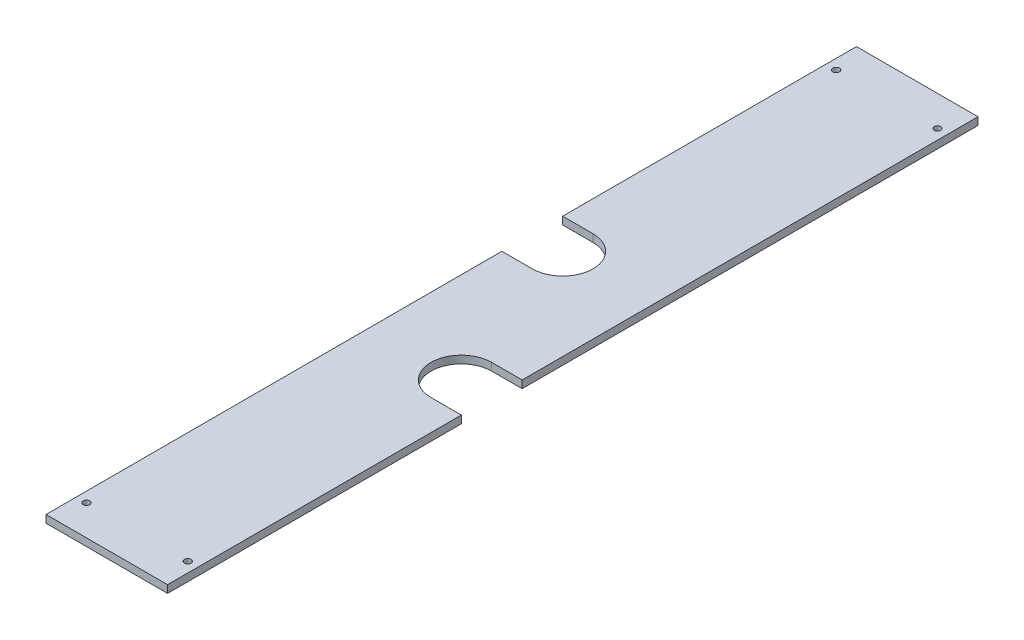
ISO-10303-21;
HEADER;
FILE_DESCRIPTION(('STEP AP214'),'2;1');
FILE_NAME('part.step','',(''),(''),'','','');
FILE_SCHEMA(('AUTOMOTIVE_DESIGN { 1 0 10303 214 1 1 1 1 }'));
ENDSEC;
DATA;
#1=APPLICATION_CONTEXT('core data for automotive mechanical design processes');
#2=APPLICATION_PROTOCOL_DEFINITION('international standard','automotive_design',2000,#1);
#3=PRODUCT_CONTEXT('',#1,'mechanical');
#4=PRODUCT('Part','Part','',(#3));
#5=PRODUCT_RELATED_PRODUCT_CATEGORY('part','',(#4));
#6=PRODUCT_DEFINITION_FORMATION('','',#4);
#7=PRODUCT_DEFINITION_CONTEXT('part definition',#1,'design');
#8=PRODUCT_DEFINITION('design','',#6,#7);
#9=PRODUCT_DEFINITION_SHAPE('','',#8);
#10=(LENGTH_UNIT() NAMED_UNIT(*) SI_UNIT(.MILLI.,.METRE.));
#11=(NAMED_UNIT(*) PLANE_ANGLE_UNIT() SI_UNIT($,.RADIAN.));
#12=(NAMED_UNIT(*) SI_UNIT($,.STERADIAN.) SOLID_ANGLE_UNIT());
#13=UNCERTAINTY_MEASURE_WITH_UNIT(LENGTH_MEASURE(1.E-05),#10,'distance_accuracy_value','');
#14=(GEOMETRIC_REPRESENTATION_CONTEXT(3) GLOBAL_UNCERTAINTY_ASSIGNED_CONTEXT((#13)) GLOBAL_UNIT_ASSIGNED_CONTEXT((#10,
#11,#12)) REPRESENTATION_CONTEXT('',''));
#15=CARTESIAN_POINT('',(0.,0.,0.));
#16=DIRECTION('',(0.,0.,1.));
#17=DIRECTION('',(1.,0.,0.));
#18=AXIS2_PLACEMENT_3D('',#15,#16,#17);
#19=CARTESIAN_POINT('',(-38.1,22.8952505991963,508.));
#20=DIRECTION('',(1.,0.,0.));
#21=DIRECTION('',(0.,0.,-1.));
#22=AXIS2_PLACEMENT_3D('',#19,#20,#21);
#23=PLANE('',#22);
#24=DIRECTION('',(0.,0.,-1.));
#25=VECTOR('',#24,1.);
#26=CARTESIAN_POINT('',(-38.1,22.8952505991963,508.));
#27=LINE('',#26,#25);
#28=CARTESIAN_POINT('',(-38.1,22.8952505991963,508.));
#29=VERTEX_POINT('',#28);
#30=CARTESIAN_POINT('',(-38.1,22.8952505991963,222.25));
#31=VERTEX_POINT('',#30);
#32=EDGE_CURVE('E211',#29,#31,#27,.T.);
#33=ORIENTED_EDGE('',*,*,#32,.T.);
#34=DIRECTION('',(0.,1.,0.));
#35=VECTOR('',#34,1.);
#36=CARTESIAN_POINT('',(-38.1,18.1327505991963,222.25));
#37=LINE('',#36,#35);
#38=CARTESIAN_POINT('',(-38.1,18.1327505991963,222.25));
#39=VERTEX_POINT('',#38);
#40=EDGE_CURVE('E160',#39,#31,#37,.T.);
#41=ORIENTED_EDGE('',*,*,#40,.F.);
#42=DIRECTION('',(0.,0.,-1.));
#43=VECTOR('',#42,1.);
#44=CARTESIAN_POINT('',(-38.1,18.1327505991963,508.));
#45=LINE('',#44,#43);
#46=CARTESIAN_POINT('',(-38.1,18.1327505991963,508.));
#47=VERTEX_POINT('',#46);
#48=EDGE_CURVE('E11',#47,#39,#45,.T.);
#49=ORIENTED_EDGE('',*,*,#48,.F.);
#50=DIRECTION('',(0.,-1.,0.));
#51=VECTOR('',#50,1.);
#52=CARTESIAN_POINT('',(-38.1,22.8952505991963,508.));
#53=LINE('',#52,#51);
#54=EDGE_CURVE('E188',#29,#47,#53,.T.);
#55=ORIENTED_EDGE('',*,*,#54,.F.);
#56=EDGE_LOOP('',(#33,#41,#49,#55));
#57=FACE_BOUND('',#56,.T.);
#58=ADVANCED_FACE('F39',(#57),#23,.F.);
#59=CARTESIAN_POINT('',(38.1,22.8952505991963,508.));
#60=DIRECTION('',(1.,0.,0.));
#61=DIRECTION('',(0.,0.,-1.));
#62=AXIS2_PLACEMENT_3D('',#59,#60,#61);
#63=PLANE('',#62);
#64=DIRECTION('',(0.,1.,0.));
#65=VECTOR('',#64,1.);
#66=CARTESIAN_POINT('',(38.1,18.1327505991963,285.75));
#67=LINE('',#66,#65);
#68=CARTESIAN_POINT('',(38.1,18.1327505991963,285.75));
#69=VERTEX_POINT('',#68);
#70=CARTESIAN_POINT('',(38.1,22.8952505991963,285.75));
#71=VERTEX_POINT('',#70);
#72=EDGE_CURVE('E169',#69,#71,#67,.T.);
#73=ORIENTED_EDGE('',*,*,#72,.F.);
#74=DIRECTION('',(0.,0.,-1.));
#75=VECTOR('',#74,1.);
#76=CARTESIAN_POINT('',(38.1,18.1327505991963,508.));
#77=LINE('',#76,#75);
#78=CARTESIAN_POINT('',(38.1,18.1327505991963,0.));
#79=VERTEX_POINT('',#78);
#80=EDGE_CURVE('E217',#69,#79,#77,.T.);
#81=ORIENTED_EDGE('',*,*,#80,.T.);
#82=DIRECTION('',(0.,-1.,0.));
#83=VECTOR('',#82,1.);
#84=CARTESIAN_POINT('',(38.1,22.8952505991963,0.));
#85=LINE('',#84,#83);
#86=CARTESIAN_POINT('',(38.1,22.8952505991963,0.));
#87=VERTEX_POINT('',#86);
#88=EDGE_CURVE('E206',#87,#79,#85,.T.);
#89=ORIENTED_EDGE('',*,*,#88,.F.);
#90=DIRECTION('',(0.,0.,-1.));
#91=VECTOR('',#90,1.);
#92=CARTESIAN_POINT('',(38.1,22.8952505991963,508.));
#93=LINE('',#92,#91);
#94=EDGE_CURVE('E214',#71,#87,#93,.T.);
#95=ORIENTED_EDGE('',*,*,#94,.F.);
#96=EDGE_LOOP('',(#73,#81,#89,#95));
#97=FACE_BOUND('',#96,.T.);
#98=ADVANCED_FACE('F226',(#97),#63,.T.);
#99=CARTESIAN_POINT('',(-38.1,18.1327505991963,184.15));
#100=VERTEX_POINT('',#99);
#101=CARTESIAN_POINT('',(-38.1,18.1327505991963,0.));
#102=VERTEX_POINT('',#101);
#103=EDGE_CURVE('E47',#100,#102,#45,.T.);
#104=ORIENTED_EDGE('',*,*,#103,.F.);
#105=DIRECTION('',(0.,1.,0.));
#106=VECTOR('',#105,1.);
#107=CARTESIAN_POINT('',(-38.1,18.1327505991963,184.15));
#108=LINE('',#107,#106);
#109=CARTESIAN_POINT('',(-38.1,22.8952505991963,184.15));
#110=VERTEX_POINT('',#109);
#111=EDGE_CURVE('E134',#100,#110,#108,.T.);
#112=ORIENTED_EDGE('',*,*,#111,.T.);
#113=CARTESIAN_POINT('',(-38.1,22.8952505991963,0.));
#114=VERTEX_POINT('',#113);
#115=EDGE_CURVE('E200',#110,#114,#27,.T.);
#116=ORIENTED_EDGE('',*,*,#115,.T.);
#117=DIRECTION('',(0.,-1.,0.));
#118=VECTOR('',#117,1.);
#119=CARTESIAN_POINT('',(-38.1,22.8952505991963,0.));
#120=LINE('',#119,#118);
#121=EDGE_CURVE('E159',#114,#102,#120,.T.);
#122=ORIENTED_EDGE('',*,*,#121,.T.);
#123=EDGE_LOOP('',(#104,#112,#116,#122));
#124=FACE_BOUND('',#123,.T.);
#125=ADVANCED_FACE('F41',(#124),#23,.F.);
#126=CARTESIAN_POINT('',(-38.1,18.1327505991963,508.));
#127=DIRECTION('',(0.,1.,0.));
#128=DIRECTION('',(0.,0.,1.));
#129=AXIS2_PLACEMENT_3D('',#126,#127,#128);
#130=PLANE('',#129);
#131=CARTESIAN_POINT('',(-31.75,18.1327505991963,19.05));
#132=DIRECTION('',(0.,-1.,0.));
#133=DIRECTION('',(0.,0.,-1.));
#134=AXIS2_PLACEMENT_3D('',#131,#132,#133);
#135=CIRCLE('',#134,2.08280000000002);
#136=CARTESIAN_POINT('',(-31.75,18.1327505991963,16.9672));
#137=VERTEX_POINT('',#136);
#138=EDGE_CURVE('E447',#137,#137,#135,.T.);
#139=ORIENTED_EDGE('',*,*,#138,.F.);
#140=EDGE_LOOP('',(#139));
#141=FACE_BOUND('',#140,.T.);
#142=CARTESIAN_POINT('',(31.75,18.1327505991963,488.95));
#143=DIRECTION('',(0.,-1.,0.));
#144=DIRECTION('',(0.,0.,-1.));
#145=AXIS2_PLACEMENT_3D('',#142,#143,#144);
#146=CIRCLE('',#145,2.0828);
#147=CARTESIAN_POINT('',(31.75,18.1327505991963,486.8672));
#148=VERTEX_POINT('',#147);
#149=EDGE_CURVE('E451',#148,#148,#146,.T.);
#150=ORIENTED_EDGE('',*,*,#149,.F.);
#151=EDGE_LOOP('',(#150));
#152=FACE_BOUND('',#151,.T.);
#153=CARTESIAN_POINT('',(-31.75,18.1327505991963,488.95));
#154=DIRECTION('',(0.,1.,0.));
#155=DIRECTION('',(0.,0.,1.));
#156=AXIS2_PLACEMENT_3D('',#153,#154,#155);
#157=CIRCLE('',#156,2.08280000000002);
#158=CARTESIAN_POINT('',(-31.75,18.1327505991963,491.0328));
#159=VERTEX_POINT('',#158);
#160=EDGE_CURVE('E173',#159,#159,#157,.T.);
#161=ORIENTED_EDGE('',*,*,#160,.T.);
#162=EDGE_LOOP('',(#161));
#163=FACE_BOUND('',#162,.T.);
#164=CARTESIAN_POINT('',(31.75,18.1327505991963,19.05));
#165=DIRECTION('',(0.,1.,0.));
#166=DIRECTION('',(0.,0.,1.));
#167=AXIS2_PLACEMENT_3D('',#164,#165,#166);
#168=CIRCLE('',#167,2.0828);
#169=CARTESIAN_POINT('',(31.75,18.1327505991963,21.1328));
#170=VERTEX_POINT('',#169);
#171=EDGE_CURVE('E151',#170,#170,#168,.T.);
#172=ORIENTED_EDGE('',*,*,#171,.T.);
#173=EDGE_LOOP('',(#172));
#174=FACE_BOUND('',#173,.T.);
#175=ORIENTED_EDGE('',*,*,#48,.T.);
#176=DIRECTION('',(1.,0.,0.));
#177=VECTOR('',#176,1.);
#178=CARTESIAN_POINT('',(-38.1,18.1327505991963,222.25));
#179=LINE('',#178,#177);
#180=CARTESIAN_POINT('',(-19.05,18.1327505991963,222.25));
#181=VERTEX_POINT('',#180);
#182=EDGE_CURVE('E135',#39,#181,#179,.T.);
#183=ORIENTED_EDGE('',*,*,#182,.T.);
#184=CARTESIAN_POINT('',(-19.05,18.1327505991963,203.2));
#185=DIRECTION('',(0.,1.,0.));
#186=DIRECTION('',(0.,0.,1.));
#187=AXIS2_PLACEMENT_3D('',#184,#185,#186);
#188=CIRCLE('',#187,19.05);
#189=CARTESIAN_POINT('',(-19.05,18.1327505991963,184.15));
#190=VERTEX_POINT('',#189);
#191=EDGE_CURVE('E130',#181,#190,#188,.T.);
#192=ORIENTED_EDGE('',*,*,#191,.T.);
#193=DIRECTION('',(-1.,0.,0.));
#194=VECTOR('',#193,1.);
#195=CARTESIAN_POINT('',(-19.05,18.1327505991963,184.15));
#196=LINE('',#195,#194);
#197=EDGE_CURVE('E138',#190,#100,#196,.T.);
#198=ORIENTED_EDGE('',*,*,#197,.T.);
#199=ORIENTED_EDGE('',*,*,#103,.T.);
#200=DIRECTION('',(1.,0.,0.));
#201=VECTOR('',#200,1.);
#202=CARTESIAN_POINT('',(-38.1,18.1327505991963,0.));
#203=LINE('',#202,#201);
#204=EDGE_CURVE('E203',#102,#79,#203,.T.);
#205=ORIENTED_EDGE('',*,*,#204,.T.);
#206=ORIENTED_EDGE('',*,*,#80,.F.);
#207=DIRECTION('',(-1.,0.,0.));
#208=VECTOR('',#207,1.);
#209=CARTESIAN_POINT('',(38.1,18.1327505991963,285.75));
#210=LINE('',#209,#208);
#211=CARTESIAN_POINT('',(19.05,18.1327505991963,285.75));
#212=VERTEX_POINT('',#211);
#213=EDGE_CURVE('E165',#69,#212,#210,.T.);
#214=ORIENTED_EDGE('',*,*,#213,.T.);
#215=CARTESIAN_POINT('',(19.05,18.1327505991963,304.8));
#216=DIRECTION('',(0.,1.,0.));
#217=DIRECTION('',(0.,0.,1.));
#218=AXIS2_PLACEMENT_3D('',#215,#216,#217);
#219=CIRCLE('',#218,19.05);
#220=CARTESIAN_POINT('',(19.05,18.1327505991963,323.85));
#221=VERTEX_POINT('',#220);
#222=EDGE_CURVE('E178',#212,#221,#219,.T.);
#223=ORIENTED_EDGE('',*,*,#222,.T.);
#224=DIRECTION('',(1.,0.,0.));
#225=VECTOR('',#224,1.);
#226=CARTESIAN_POINT('',(19.05,18.1327505991963,323.85));
#227=LINE('',#226,#225);
#228=CARTESIAN_POINT('',(38.1,18.1327505991963,323.85));
#229=VERTEX_POINT('',#228);
#230=EDGE_CURVE('E183',#221,#229,#227,.T.);
#231=ORIENTED_EDGE('',*,*,#230,.T.);
#232=CARTESIAN_POINT('',(38.1,18.1327505991963,508.));
#233=VERTEX_POINT('',#232);
#234=EDGE_CURVE('E218',#233,#229,#77,.T.);
#235=ORIENTED_EDGE('',*,*,#234,.F.);
#236=DIRECTION('',(1.,0.,0.));
#237=VECTOR('',#236,1.);
#238=CARTESIAN_POINT('',(-38.1,18.1327505991963,508.));
#239=LINE('',#238,#237);
#240=EDGE_CURVE('E191',#47,#233,#239,.T.);
#241=ORIENTED_EDGE('',*,*,#240,.F.);
#242=EDGE_LOOP('',(#175,#183,#192,#198,#199,#205,#206,#214,#223,#231,#235,#241));
#243=FACE_BOUND('',#242,.T.);
#244=ADVANCED_FACE('F144',(#141,#152,#163,#174,#243),#130,.F.);
#245=DIRECTION('',(0.,1.,0.));
#246=VECTOR('',#245,1.);
#247=CARTESIAN_POINT('',(38.1,18.1327505991963,323.85));
#248=LINE('',#247,#246);
#249=CARTESIAN_POINT('',(38.1,22.8952505991963,323.85));
#250=VERTEX_POINT('',#249);
#251=EDGE_CURVE('E166',#229,#250,#248,.T.);
#252=ORIENTED_EDGE('',*,*,#251,.T.);
#253=CARTESIAN_POINT('',(38.1,22.8952505991963,508.));
#254=VERTEX_POINT('',#253);
#255=EDGE_CURVE('E215',#254,#250,#93,.T.);
#256=ORIENTED_EDGE('',*,*,#255,.F.);
#257=DIRECTION('',(0.,-1.,0.));
#258=VECTOR('',#257,1.);
#259=CARTESIAN_POINT('',(38.1,22.8952505991963,508.));
#260=LINE('',#259,#258);
#261=EDGE_CURVE('E194',#254,#233,#260,.T.);
#262=ORIENTED_EDGE('',*,*,#261,.T.);
#263=ORIENTED_EDGE('',*,*,#234,.T.);
#264=EDGE_LOOP('',(#252,#256,#262,#263));
#265=FACE_BOUND('',#264,.T.);
#266=ADVANCED_FACE('F246',(#265),#63,.T.);
#267=CARTESIAN_POINT('',(-38.1,22.8952505991963,508.));
#268=DIRECTION('',(0.,1.,0.));
#269=DIRECTION('',(0.,0.,1.));
#270=AXIS2_PLACEMENT_3D('',#267,#268,#269);
#271=PLANE('',#270);
#272=CARTESIAN_POINT('',(-31.75,22.8952505991963,19.05));
#273=DIRECTION('',(0.,-1.,0.));
#274=DIRECTION('',(0.,0.,-1.));
#275=AXIS2_PLACEMENT_3D('',#272,#273,#274);
#276=CIRCLE('',#275,2.08280000000002);
#277=CARTESIAN_POINT('',(-31.75,22.8952505991963,16.9672));
#278=VERTEX_POINT('',#277);
#279=EDGE_CURVE('E450',#278,#278,#276,.T.);
#280=ORIENTED_EDGE('',*,*,#279,.T.);
#281=EDGE_LOOP('',(#280));
#282=FACE_BOUND('',#281,.T.);
#283=CARTESIAN_POINT('',(31.75,22.8952505991963,488.95));
#284=DIRECTION('',(0.,-1.,0.));
#285=DIRECTION('',(0.,0.,-1.));
#286=AXIS2_PLACEMENT_3D('',#283,#284,#285);
#287=CIRCLE('',#286,2.0828);
#288=CARTESIAN_POINT('',(31.75,22.8952505991963,486.8672));
#289=VERTEX_POINT('',#288);
#290=EDGE_CURVE('E455',#289,#289,#287,.T.);
#291=ORIENTED_EDGE('',*,*,#290,.T.);
#292=EDGE_LOOP('',(#291));
#293=FACE_BOUND('',#292,.T.);
#294=CARTESIAN_POINT('',(-31.75,22.8952505991963,488.95));
#295=DIRECTION('',(0.,1.,0.));
#296=DIRECTION('',(0.,0.,1.));
#297=AXIS2_PLACEMENT_3D('',#294,#295,#296);
#298=CIRCLE('',#297,2.08280000000002);
#299=CARTESIAN_POINT('',(-31.75,22.8952505991963,491.0328));
#300=VERTEX_POINT('',#299);
#301=EDGE_CURVE('E462',#300,#300,#298,.T.);
#302=ORIENTED_EDGE('',*,*,#301,.F.);
#303=EDGE_LOOP('',(#302));
#304=FACE_BOUND('',#303,.T.);
#305=CARTESIAN_POINT('',(31.75,22.8952505991963,19.05));
#306=DIRECTION('',(0.,1.,0.));
#307=DIRECTION('',(0.,0.,1.));
#308=AXIS2_PLACEMENT_3D('',#305,#306,#307);
#309=CIRCLE('',#308,2.0828);
#310=CARTESIAN_POINT('',(31.75,22.8952505991963,21.1328));
#311=VERTEX_POINT('',#310);
#312=EDGE_CURVE('E464',#311,#311,#309,.T.);
#313=ORIENTED_EDGE('',*,*,#312,.F.);
#314=EDGE_LOOP('',(#313));
#315=FACE_BOUND('',#314,.T.);
#316=DIRECTION('',(1.,0.,0.));
#317=VECTOR('',#316,1.);
#318=CARTESIAN_POINT('',(-38.1,22.8952505991963,222.25));
#319=LINE('',#318,#317);
#320=CARTESIAN_POINT('',(-19.05,22.8952505991963,222.25));
#321=VERTEX_POINT('',#320);
#322=EDGE_CURVE('E145',#31,#321,#319,.T.);
#323=ORIENTED_EDGE('',*,*,#322,.F.);
#324=ORIENTED_EDGE('',*,*,#32,.F.);
#325=DIRECTION('',(1.,0.,0.));
#326=VECTOR('',#325,1.);
#327=CARTESIAN_POINT('',(-38.1,22.8952505991963,508.));
#328=LINE('',#327,#326);
#329=EDGE_CURVE('E197',#29,#254,#328,.T.);
#330=ORIENTED_EDGE('',*,*,#329,.T.);
#331=ORIENTED_EDGE('',*,*,#255,.T.);
#332=DIRECTION('',(1.,0.,0.));
#333=VECTOR('',#332,1.);
#334=CARTESIAN_POINT('',(19.05,22.8952505991963,323.85));
#335=LINE('',#334,#333);
#336=CARTESIAN_POINT('',(19.05,22.8952505991963,323.85));
#337=VERTEX_POINT('',#336);
#338=EDGE_CURVE('E177',#337,#250,#335,.T.);
#339=ORIENTED_EDGE('',*,*,#338,.F.);
#340=CARTESIAN_POINT('',(19.05,22.8952505991963,304.8));
#341=DIRECTION('',(0.,1.,0.));
#342=DIRECTION('',(0.,0.,1.));
#343=AXIS2_PLACEMENT_3D('',#340,#341,#342);
#344=CIRCLE('',#343,19.05);
#345=CARTESIAN_POINT('',(19.05,22.8952505991963,285.75));
#346=VERTEX_POINT('',#345);
#347=EDGE_CURVE('E62',#346,#337,#344,.T.);
#348=ORIENTED_EDGE('',*,*,#347,.F.);
#349=DIRECTION('',(-1.,0.,0.));
#350=VECTOR('',#349,1.);
#351=CARTESIAN_POINT('',(38.1,22.8952505991963,285.75));
#352=LINE('',#351,#350);
#353=EDGE_CURVE('E174',#71,#346,#352,.T.);
#354=ORIENTED_EDGE('',*,*,#353,.F.);
#355=ORIENTED_EDGE('',*,*,#94,.T.);
#356=DIRECTION('',(1.,0.,0.));
#357=VECTOR('',#356,1.);
#358=CARTESIAN_POINT('',(-38.1,22.8952505991963,0.));
#359=LINE('',#358,#357);
#360=EDGE_CURVE('E192',#114,#87,#359,.T.);
#361=ORIENTED_EDGE('',*,*,#360,.F.);
#362=ORIENTED_EDGE('',*,*,#115,.F.);
#363=DIRECTION('',(-1.,0.,0.));
#364=VECTOR('',#363,1.);
#365=CARTESIAN_POINT('',(-19.05,22.8952505991963,184.15));
#366=LINE('',#365,#364);
#367=CARTESIAN_POINT('',(-19.05,22.8952505991963,184.15));
#368=VERTEX_POINT('',#367);
#369=EDGE_CURVE('E148',#368,#110,#366,.T.);
#370=ORIENTED_EDGE('',*,*,#369,.F.);
#371=CARTESIAN_POINT('',(-19.05,22.8952505991963,203.2));
#372=DIRECTION('',(0.,1.,0.));
#373=DIRECTION('',(0.,0.,1.));
#374=AXIS2_PLACEMENT_3D('',#371,#372,#373);
#375=CIRCLE('',#374,19.05);
#376=EDGE_CURVE('E54',#321,#368,#375,.T.);
#377=ORIENTED_EDGE('',*,*,#376,.F.);
#378=EDGE_LOOP('',(#323,#324,#330,#331,#339,#348,#354,#355,#361,#362,#370,#377));
#379=FACE_BOUND('',#378,.T.);
#380=ADVANCED_FACE('F236',(#282,#293,#304,#315,#379),#271,.T.);
#381=CARTESIAN_POINT('',(0.,0.,508.));
#382=DIRECTION('',(0.,0.,1.));
#383=DIRECTION('',(1.,0.,0.));
#384=AXIS2_PLACEMENT_3D('',#381,#382,#383);
#385=PLANE('',#384);
#386=ORIENTED_EDGE('',*,*,#54,.T.);
#387=ORIENTED_EDGE('',*,*,#240,.T.);
#388=ORIENTED_EDGE('',*,*,#261,.F.);
#389=ORIENTED_EDGE('',*,*,#329,.F.);
#390=EDGE_LOOP('',(#386,#387,#388,#389));
#391=FACE_BOUND('',#390,.T.);
#392=ADVANCED_FACE('F251',(#391),#385,.T.);
#393=CARTESIAN_POINT('',(0.,0.,0.));
#394=DIRECTION('',(0.,0.,1.));
#395=DIRECTION('',(1.,0.,0.));
#396=AXIS2_PLACEMENT_3D('',#393,#394,#395);
#397=PLANE('',#396);
#398=ORIENTED_EDGE('',*,*,#121,.F.);
#399=ORIENTED_EDGE('',*,*,#360,.T.);
#400=ORIENTED_EDGE('',*,*,#88,.T.);
#401=ORIENTED_EDGE('',*,*,#204,.F.);
#402=EDGE_LOOP('',(#398,#399,#400,#401));
#403=FACE_BOUND('',#402,.T.);
#404=ADVANCED_FACE('F231',(#403),#397,.F.);
#405=CARTESIAN_POINT('',(19.05,18.1327505991963,304.8));
#406=DIRECTION('',(0.,1.,0.));
#407=DIRECTION('',(0.,0.,1.));
#408=AXIS2_PLACEMENT_3D('',#405,#406,#407);
#409=CYLINDRICAL_SURFACE('',#408,19.05);
#410=ORIENTED_EDGE('',*,*,#347,.T.);
#411=DIRECTION('',(0.,1.,0.));
#412=VECTOR('',#411,1.);
#413=CARTESIAN_POINT('',(19.05,18.1327505991963,323.85));
#414=LINE('',#413,#412);
#415=EDGE_CURVE('E163',#221,#337,#414,.T.);
#416=ORIENTED_EDGE('',*,*,#415,.F.);
#417=ORIENTED_EDGE('',*,*,#222,.F.);
#418=DIRECTION('',(0.,1.,0.));
#419=VECTOR('',#418,1.);
#420=CARTESIAN_POINT('',(19.05,18.1327505991963,285.75));
#421=LINE('',#420,#419);
#422=EDGE_CURVE('E171',#212,#346,#421,.T.);
#423=ORIENTED_EDGE('',*,*,#422,.T.);
#424=EDGE_LOOP('',(#410,#416,#417,#423));
#425=FACE_BOUND('',#424,.T.);
#426=ADVANCED_FACE('F243',(#425),#409,.F.);
#427=CARTESIAN_POINT('',(38.1,18.1327505991963,285.75));
#428=DIRECTION('',(0.,0.,-1.));
#429=DIRECTION('',(-1.,0.,0.));
#430=AXIS2_PLACEMENT_3D('',#427,#428,#429);
#431=PLANE('',#430);
#432=ORIENTED_EDGE('',*,*,#353,.T.);
#433=ORIENTED_EDGE('',*,*,#422,.F.);
#434=ORIENTED_EDGE('',*,*,#213,.F.);
#435=ORIENTED_EDGE('',*,*,#72,.T.);
#436=EDGE_LOOP('',(#432,#433,#434,#435));
#437=FACE_BOUND('',#436,.T.);
#438=ADVANCED_FACE('F240',(#437),#431,.F.);
#439=CARTESIAN_POINT('',(19.05,18.1327505991963,323.85));
#440=DIRECTION('',(0.,0.,1.));
#441=DIRECTION('',(1.,0.,0.));
#442=AXIS2_PLACEMENT_3D('',#439,#440,#441);
#443=PLANE('',#442);
#444=ORIENTED_EDGE('',*,*,#338,.T.);
#445=ORIENTED_EDGE('',*,*,#251,.F.);
#446=ORIENTED_EDGE('',*,*,#230,.F.);
#447=ORIENTED_EDGE('',*,*,#415,.T.);
#448=EDGE_LOOP('',(#444,#445,#446,#447));
#449=FACE_BOUND('',#448,.T.);
#450=ADVANCED_FACE('F245',(#449),#443,.F.);
#451=CARTESIAN_POINT('',(-19.05,18.1327505991963,203.2));
#452=DIRECTION('',(0.,1.,0.));
#453=DIRECTION('',(0.,0.,1.));
#454=AXIS2_PLACEMENT_3D('',#451,#452,#453);
#455=CYLINDRICAL_SURFACE('',#454,19.05);
#456=ORIENTED_EDGE('',*,*,#376,.T.);
#457=DIRECTION('',(0.,1.,0.));
#458=VECTOR('',#457,1.);
#459=CARTESIAN_POINT('',(-19.05,18.1327505991963,184.15));
#460=LINE('',#459,#458);
#461=EDGE_CURVE('E126',#190,#368,#460,.T.);
#462=ORIENTED_EDGE('',*,*,#461,.F.);
#463=ORIENTED_EDGE('',*,*,#191,.F.);
#464=DIRECTION('',(0.,1.,0.));
#465=VECTOR('',#464,1.);
#466=CARTESIAN_POINT('',(-19.05,18.1327505991963,222.25));
#467=LINE('',#466,#465);
#468=EDGE_CURVE('E157',#181,#321,#467,.T.);
#469=ORIENTED_EDGE('',*,*,#468,.T.);
#470=EDGE_LOOP('',(#456,#462,#463,#469));
#471=FACE_BOUND('',#470,.T.);
#472=ADVANCED_FACE('F128',(#471),#455,.F.);
#473=CARTESIAN_POINT('',(-38.1,18.1327505991963,222.25));
#474=DIRECTION('',(0.,0.,1.));
#475=DIRECTION('',(1.,0.,0.));
#476=AXIS2_PLACEMENT_3D('',#473,#474,#475);
#477=PLANE('',#476);
#478=ORIENTED_EDGE('',*,*,#322,.T.);
#479=ORIENTED_EDGE('',*,*,#468,.F.);
#480=ORIENTED_EDGE('',*,*,#182,.F.);
#481=ORIENTED_EDGE('',*,*,#40,.T.);
#482=EDGE_LOOP('',(#478,#479,#480,#481));
#483=FACE_BOUND('',#482,.T.);
#484=ADVANCED_FACE('F256',(#483),#477,.F.);
#485=CARTESIAN_POINT('',(-19.05,18.1327505991963,184.15));
#486=DIRECTION('',(0.,0.,-1.));
#487=DIRECTION('',(-1.,0.,0.));
#488=AXIS2_PLACEMENT_3D('',#485,#486,#487);
#489=PLANE('',#488);
#490=ORIENTED_EDGE('',*,*,#369,.T.);
#491=ORIENTED_EDGE('',*,*,#111,.F.);
#492=ORIENTED_EDGE('',*,*,#197,.F.);
#493=ORIENTED_EDGE('',*,*,#461,.T.);
#494=EDGE_LOOP('',(#490,#491,#492,#493));
#495=FACE_BOUND('',#494,.T.);
#496=ADVANCED_FACE('F139',(#495),#489,.F.);
#497=CARTESIAN_POINT('',(31.75,18.1327505991963,19.05));
#498=DIRECTION('',(0.,1.,0.));
#499=DIRECTION('',(0.,0.,1.));
#500=AXIS2_PLACEMENT_3D('',#497,#498,#499);
#501=CYLINDRICAL_SURFACE('',#500,2.0828);
#502=ORIENTED_EDGE('',*,*,#171,.F.);
#503=EDGE_LOOP('',(#502));
#504=FACE_BOUND('',#503,.T.);
#505=ORIENTED_EDGE('',*,*,#312,.T.);
#506=EDGE_LOOP('',(#505));
#507=FACE_BOUND('',#506,.T.);
#508=ADVANCED_FACE('F346',(#504,#507),#501,.F.);
#509=CARTESIAN_POINT('',(-31.75,18.1327505991963,488.95));
#510=DIRECTION('',(0.,1.,0.));
#511=DIRECTION('',(0.,0.,1.));
#512=AXIS2_PLACEMENT_3D('',#509,#510,#511);
#513=CYLINDRICAL_SURFACE('',#512,2.08280000000002);
#514=ORIENTED_EDGE('',*,*,#160,.F.);
#515=EDGE_LOOP('',(#514));
#516=FACE_BOUND('',#515,.T.);
#517=ORIENTED_EDGE('',*,*,#301,.T.);
#518=EDGE_LOOP('',(#517));
#519=FACE_BOUND('',#518,.T.);
#520=ADVANCED_FACE('F356',(#516,#519),#513,.F.);
#521=CARTESIAN_POINT('',(31.75,18.1327505991963,488.95));
#522=DIRECTION('',(0.,1.,0.));
#523=DIRECTION('',(0.,0.,1.));
#524=AXIS2_PLACEMENT_3D('',#521,#522,#523);
#525=CYLINDRICAL_SURFACE('',#524,2.0828);
#526=ORIENTED_EDGE('',*,*,#149,.T.);
#527=EDGE_LOOP('',(#526));
#528=FACE_BOUND('',#527,.T.);
#529=ORIENTED_EDGE('',*,*,#290,.F.);
#530=EDGE_LOOP('',(#529));
#531=FACE_BOUND('',#530,.T.);
#532=ADVANCED_FACE('F367',(#528,#531),#525,.F.);
#533=CARTESIAN_POINT('',(-31.75,18.1327505991963,19.05));
#534=DIRECTION('',(0.,1.,0.));
#535=DIRECTION('',(0.,0.,1.));
#536=AXIS2_PLACEMENT_3D('',#533,#534,#535);
#537=CYLINDRICAL_SURFACE('',#536,2.08280000000002);
#538=ORIENTED_EDGE('',*,*,#138,.T.);
#539=EDGE_LOOP('',(#538));
#540=FACE_BOUND('',#539,.T.);
#541=ORIENTED_EDGE('',*,*,#279,.F.);
#542=EDGE_LOOP('',(#541));
#543=FACE_BOUND('',#542,.T.);
#544=ADVANCED_FACE('F394',(#540,#543),#537,.F.);
#545=CLOSED_SHELL('',(#58,#98,#125,#244,#266,#380,#392,#404,#426,#438,#450,#472,#484,#496,#508,
#520,#532,#544));
#546=MANIFOLD_SOLID_BREP('B2',#545);
#547=ADVANCED_BREP_SHAPE_REPRESENTATION('',(#18,#546),#14);
#548=SHAPE_DEFINITION_REPRESENTATION(#9,#547);
ENDSEC;
END-ISO-10303-21;
